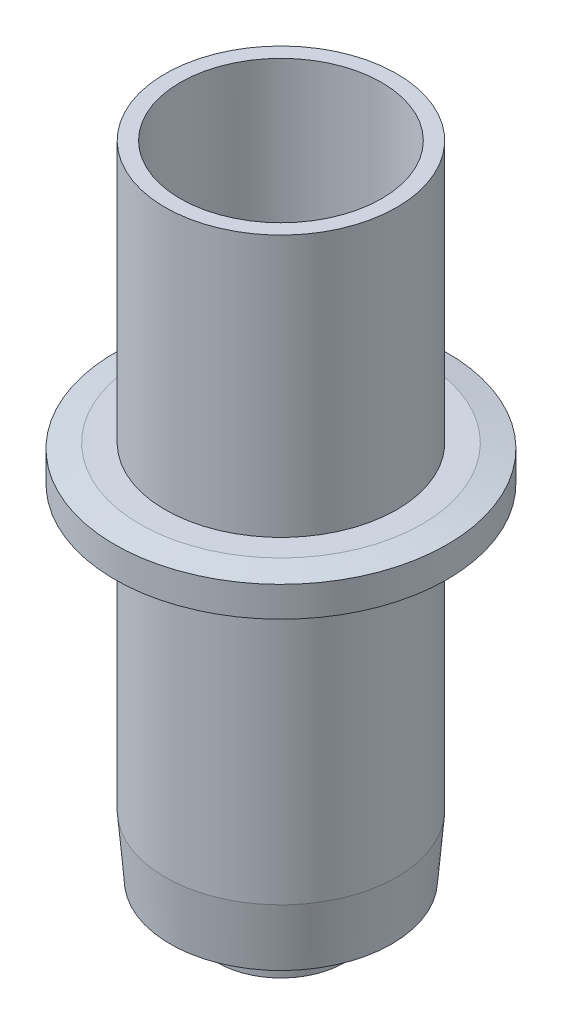
ISO-10303-21;
HEADER;
FILE_DESCRIPTION(('STEP AP214'),'2;1');
FILE_NAME('part.step','',(''),(''),'','','');
FILE_SCHEMA(('AUTOMOTIVE_DESIGN { 1 0 10303 214 1 1 1 1 }'));
ENDSEC;
DATA;
#1=APPLICATION_CONTEXT('core data for automotive mechanical design processes');
#2=APPLICATION_PROTOCOL_DEFINITION('international standard','automotive_design',2000,#1);
#3=PRODUCT_CONTEXT('',#1,'mechanical');
#4=PRODUCT('Part','Part','',(#3));
#5=PRODUCT_RELATED_PRODUCT_CATEGORY('part','',(#4));
#6=PRODUCT_DEFINITION_FORMATION('','',#4);
#7=PRODUCT_DEFINITION_CONTEXT('part definition',#1,'design');
#8=PRODUCT_DEFINITION('design','',#6,#7);
#9=PRODUCT_DEFINITION_SHAPE('','',#8);
#10=(LENGTH_UNIT() NAMED_UNIT(*) SI_UNIT(.MILLI.,.METRE.));
#11=(NAMED_UNIT(*) PLANE_ANGLE_UNIT() SI_UNIT($,.RADIAN.));
#12=(NAMED_UNIT(*) SI_UNIT($,.STERADIAN.) SOLID_ANGLE_UNIT());
#13=UNCERTAINTY_MEASURE_WITH_UNIT(LENGTH_MEASURE(1.E-05),#10,'distance_accuracy_value','');
#14=(GEOMETRIC_REPRESENTATION_CONTEXT(3) GLOBAL_UNCERTAINTY_ASSIGNED_CONTEXT((#13)) GLOBAL_UNIT_ASSIGNED_CONTEXT((#10,
#11,#12)) REPRESENTATION_CONTEXT('',''));
#15=CARTESIAN_POINT('',(0.,0.,0.));
#16=DIRECTION('',(0.,0.,1.));
#17=DIRECTION('',(1.,0.,0.));
#18=AXIS2_PLACEMENT_3D('',#15,#16,#17);
#19=CARTESIAN_POINT('',(0.,0.,0.));
#20=DIRECTION('',(0.,1.,0.));
#21=DIRECTION('',(-1.,0.,0.));
#22=AXIS2_PLACEMENT_3D('',#19,#20,#21);
#23=CONICAL_SURFACE('',#22,3.,0.036347621019028);
#24=CARTESIAN_POINT('',(0.,5.50000000000001,0.));
#25=DIRECTION('',(0.,-1.,0.));
#26=DIRECTION('',(1.,0.,0.));
#27=AXIS2_PLACEMENT_3D('',#24,#25,#26);
#28=CIRCLE('',#27,3.20000000000004);
#29=CARTESIAN_POINT('',(3.20000000000002,5.50000000000002,0.));
#30=VERTEX_POINT('',#29);
#31=EDGE_CURVE('E51',#30,#30,#28,.T.);
#32=ORIENTED_EDGE('',*,*,#31,.T.);
#33=EDGE_LOOP('',(#32));
#34=FACE_BOUND('',#33,.T.);
#35=CARTESIAN_POINT('',(0.,3.49999999999999,0.));
#36=DIRECTION('',(0.,-1.,0.));
#37=DIRECTION('',(1.,0.,0.));
#38=AXIS2_PLACEMENT_3D('',#35,#36,#37);
#39=CIRCLE('',#38,3.12727272727275);
#40=CARTESIAN_POINT('',(3.12727272727274,3.5,0.));
#41=VERTEX_POINT('',#40);
#42=EDGE_CURVE('E64',#41,#41,#39,.F.);
#43=ORIENTED_EDGE('',*,*,#42,.T.);
#44=EDGE_LOOP('',(#43));
#45=FACE_BOUND('',#44,.T.);
#46=ADVANCED_FACE('F34',(#34,#45),#23,.T.);
#47=CARTESIAN_POINT('',(0.,-1000.,-3.49148133884313E-12));
#48=DIRECTION('',(0.,-1.,0.));
#49=DIRECTION('',(0.,0.,-1.));
#50=AXIS2_PLACEMENT_3D('',#47,#48,#49);
#51=CYLINDRICAL_SURFACE('',#50,2.57500000000001);
#52=CARTESIAN_POINT('',(0.,6.86999999999993,0.));
#53=DIRECTION('',(0.,-1.,0.));
#54=DIRECTION('',(0.,0.,-1.));
#55=AXIS2_PLACEMENT_3D('',#52,#53,#54);
#56=CIRCLE('',#55,2.57500000000002);
#57=CARTESIAN_POINT('',(0.,6.86999999999994,-2.575));
#58=VERTEX_POINT('',#57);
#59=EDGE_CURVE('E52',#58,#58,#56,.T.);
#60=ORIENTED_EDGE('',*,*,#59,.F.);
#61=EDGE_LOOP('',(#60));
#62=FACE_BOUND('',#61,.T.);
#63=CARTESIAN_POINT('',(0.,3.50000000000006,0.));
#64=DIRECTION('',(0.,-1.,0.));
#65=DIRECTION('',(1.,0.,0.));
#66=AXIS2_PLACEMENT_3D('',#63,#64,#65);
#67=CIRCLE('',#66,2.57500000000001);
#68=CARTESIAN_POINT('',(2.57500000000001,3.50000000000007,0.));
#69=VERTEX_POINT('',#68);
#70=EDGE_CURVE('E37',#69,#69,#67,.F.);
#71=ORIENTED_EDGE('',*,*,#70,.F.);
#72=EDGE_LOOP('',(#71));
#73=FACE_BOUND('',#72,.T.);
#74=ADVANCED_FACE('F104',(#62,#73),#51,.F.);
#75=CARTESIAN_POINT('',(5.75,37.3,0.));
#76=DIRECTION('',(0.,1.,0.));
#77=DIRECTION('',(-1.,0.,0.));
#78=AXIS2_PLACEMENT_3D('',#75,#76,#77);
#79=PLANE('',#78);
#80=CARTESIAN_POINT('',(0.,37.3000000000001,1.30232253938849E-13));
#81=DIRECTION('',(0.,1.,0.));
#82=DIRECTION('',(-1.,0.,0.));
#83=AXIS2_PLACEMENT_3D('',#80,#81,#82);
#84=CIRCLE('',#83,5.00000000000008);
#85=CARTESIAN_POINT('',(-5.00000000000008,37.3000000000001,1.30232253938849E-13));
#86=VERTEX_POINT('',#85);
#87=EDGE_CURVE('E49',#86,#86,#84,.T.);
#88=ORIENTED_EDGE('',*,*,#87,.F.);
#89=EDGE_LOOP('',(#88));
#90=FACE_BOUND('',#89,.T.);
#91=CARTESIAN_POINT('',(-1.30232253938849E-13,37.3,0.));
#92=DIRECTION('',(0.,-1.,0.));
#93=DIRECTION('',(1.,0.,0.));
#94=AXIS2_PLACEMENT_3D('',#91,#92,#93);
#95=CIRCLE('',#94,5.75000000000013);
#96=CARTESIAN_POINT('',(5.75,37.3,0.));
#97=VERTEX_POINT('',#96);
#98=EDGE_CURVE('E12',#97,#97,#95,.T.);
#99=ORIENTED_EDGE('',*,*,#98,.F.);
#100=EDGE_LOOP('',(#99));
#101=FACE_BOUND('',#100,.T.);
#102=ADVANCED_FACE('F101',(#90,#101),#79,.T.);
#103=CARTESIAN_POINT('',(5.02600346399491E-13,-143.950460455854,0.));
#104=DIRECTION('',(0.,-1.,0.));
#105=DIRECTION('',(1.,0.,0.));
#106=AXIS2_PLACEMENT_3D('',#103,#104,#105);
#107=CYLINDRICAL_SURFACE('',#106,5.75000000000011);
#108=ORIENTED_EDGE('',*,*,#98,.T.);
#109=EDGE_LOOP('',(#108));
#110=FACE_BOUND('',#109,.T.);
#111=CARTESIAN_POINT('',(0.,24.3,0.));
#112=DIRECTION('',(0.,-1.,0.));
#113=DIRECTION('',(1.,0.,0.));
#114=AXIS2_PLACEMENT_3D('',#111,#112,#113);
#115=CIRCLE('',#114,5.75000000000009);
#116=CARTESIAN_POINT('',(5.75,24.3,0.));
#117=VERTEX_POINT('',#116);
#118=EDGE_CURVE('E41',#117,#117,#115,.T.);
#119=ORIENTED_EDGE('',*,*,#118,.F.);
#120=EDGE_LOOP('',(#119));
#121=FACE_BOUND('',#120,.T.);
#122=ADVANCED_FACE('F92',(#110,#121),#107,.T.);
#123=CARTESIAN_POINT('',(7.,24.3,0.));
#124=DIRECTION('',(0.,1.,0.));
#125=DIRECTION('',(-1.,0.,0.));
#126=AXIS2_PLACEMENT_3D('',#123,#124,#125);
#127=PLANE('',#126);
#128=ORIENTED_EDGE('',*,*,#118,.T.);
#129=EDGE_LOOP('',(#128));
#130=FACE_BOUND('',#129,.T.);
#131=CARTESIAN_POINT('',(0.,24.3,0.));
#132=DIRECTION('',(0.,-1.,0.));
#133=DIRECTION('',(1.,0.,0.));
#134=AXIS2_PLACEMENT_3D('',#131,#132,#133);
#135=CIRCLE('',#134,7.00000000000009);
#136=CARTESIAN_POINT('',(7.,24.3,0.));
#137=VERTEX_POINT('',#136);
#138=EDGE_CURVE('E46',#137,#137,#135,.T.);
#139=ORIENTED_EDGE('',*,*,#138,.F.);
#140=EDGE_LOOP('',(#139));
#141=FACE_BOUND('',#140,.T.);
#142=ADVANCED_FACE('F90',(#130,#141),#127,.T.);
#143=CARTESIAN_POINT('',(0.,24.05,0.));
#144=DIRECTION('',(0.,-1.,0.));
#145=DIRECTION('',(1.,0.,0.));
#146=AXIS2_PLACEMENT_3D('',#143,#144,#145);
#147=CONICAL_SURFACE('',#146,8.25000000000008,1.37340076694502);
#148=ORIENTED_EDGE('',*,*,#138,.T.);
#149=EDGE_LOOP('',(#148));
#150=FACE_BOUND('',#149,.T.);
#151=CARTESIAN_POINT('',(0.,24.05,0.));
#152=DIRECTION('',(0.,-1.,0.));
#153=DIRECTION('',(1.,0.,0.));
#154=AXIS2_PLACEMENT_3D('',#151,#152,#153);
#155=CIRCLE('',#154,8.25000000000008);
#156=CARTESIAN_POINT('',(8.25,24.05,0.));
#157=VERTEX_POINT('',#156);
#158=EDGE_CURVE('E82',#157,#157,#155,.T.);
#159=ORIENTED_EDGE('',*,*,#158,.F.);
#160=EDGE_LOOP('',(#159));
#161=FACE_BOUND('',#160,.T.);
#162=ADVANCED_FACE('F87',(#150,#161),#147,.T.);
#163=CARTESIAN_POINT('',(5.02600346399491E-13,-143.950460455854,0.));
#164=DIRECTION('',(0.,-1.,0.));
#165=DIRECTION('',(1.,0.,0.));
#166=AXIS2_PLACEMENT_3D('',#163,#164,#165);
#167=CYLINDRICAL_SURFACE('',#166,8.25000000000008);
#168=ORIENTED_EDGE('',*,*,#158,.T.);
#169=EDGE_LOOP('',(#168));
#170=FACE_BOUND('',#169,.T.);
#171=CARTESIAN_POINT('',(0.,22.55,0.));
#172=DIRECTION('',(0.,-1.,0.));
#173=DIRECTION('',(1.,0.,0.));
#174=AXIS2_PLACEMENT_3D('',#171,#172,#173);
#175=CIRCLE('',#174,8.25000000000008);
#176=CARTESIAN_POINT('',(8.25,22.55,0.));
#177=VERTEX_POINT('',#176);
#178=EDGE_CURVE('E79',#177,#177,#175,.T.);
#179=ORIENTED_EDGE('',*,*,#178,.F.);
#180=EDGE_LOOP('',(#179));
#181=FACE_BOUND('',#180,.T.);
#182=ADVANCED_FACE('F99',(#170,#181),#167,.T.);
#183=CARTESIAN_POINT('',(0.,22.3,0.));
#184=DIRECTION('',(0.,1.,0.));
#185=DIRECTION('',(-1.,0.,0.));
#186=AXIS2_PLACEMENT_3D('',#183,#184,#185);
#187=CONICAL_SURFACE('',#186,7.00000000000008,1.37340076694502);
#188=ORIENTED_EDGE('',*,*,#178,.T.);
#189=EDGE_LOOP('',(#188));
#190=FACE_BOUND('',#189,.T.);
#191=CARTESIAN_POINT('',(0.,22.3,0.));
#192=DIRECTION('',(0.,-1.,0.));
#193=DIRECTION('',(1.,0.,0.));
#194=AXIS2_PLACEMENT_3D('',#191,#192,#193);
#195=CIRCLE('',#194,7.00000000000008);
#196=CARTESIAN_POINT('',(7.,22.3,0.));
#197=VERTEX_POINT('',#196);
#198=EDGE_CURVE('E76',#197,#197,#195,.T.);
#199=ORIENTED_EDGE('',*,*,#198,.F.);
#200=EDGE_LOOP('',(#199));
#201=FACE_BOUND('',#200,.T.);
#202=ADVANCED_FACE('F148',(#190,#201),#187,.T.);
#203=CARTESIAN_POINT('',(5.75,22.3,0.));
#204=DIRECTION('',(0.,-1.,0.));
#205=DIRECTION('',(1.,0.,0.));
#206=AXIS2_PLACEMENT_3D('',#203,#204,#205);
#207=PLANE('',#206);
#208=ORIENTED_EDGE('',*,*,#198,.T.);
#209=EDGE_LOOP('',(#208));
#210=FACE_BOUND('',#209,.T.);
#211=CARTESIAN_POINT('',(0.,22.3,0.));
#212=DIRECTION('',(0.,-1.,0.));
#213=DIRECTION('',(1.,0.,0.));
#214=AXIS2_PLACEMENT_3D('',#211,#212,#213);
#215=CIRCLE('',#214,5.75000000000008);
#216=CARTESIAN_POINT('',(5.75,22.3,0.));
#217=VERTEX_POINT('',#216);
#218=EDGE_CURVE('E73',#217,#217,#215,.T.);
#219=ORIENTED_EDGE('',*,*,#218,.F.);
#220=EDGE_LOOP('',(#219));
#221=FACE_BOUND('',#220,.T.);
#222=ADVANCED_FACE('F144',(#210,#221),#207,.T.);
#223=CARTESIAN_POINT('',(5.02600346399491E-13,-143.950460455854,0.));
#224=DIRECTION('',(0.,-1.,0.));
#225=DIRECTION('',(1.,0.,0.));
#226=AXIS2_PLACEMENT_3D('',#223,#224,#225);
#227=CYLINDRICAL_SURFACE('',#226,5.75000000000005);
#228=ORIENTED_EDGE('',*,*,#218,.T.);
#229=EDGE_LOOP('',(#228));
#230=FACE_BOUND('',#229,.T.);
#231=CARTESIAN_POINT('',(0.,8.49999999999998,0.));
#232=DIRECTION('',(0.,-1.,0.));
#233=DIRECTION('',(1.,0.,0.));
#234=AXIS2_PLACEMENT_3D('',#231,#232,#233);
#235=CIRCLE('',#234,5.75000000000003);
#236=CARTESIAN_POINT('',(5.75,8.5,0.));
#237=VERTEX_POINT('',#236);
#238=EDGE_CURVE('E70',#237,#237,#235,.T.);
#239=ORIENTED_EDGE('',*,*,#238,.F.);
#240=EDGE_LOOP('',(#239));
#241=FACE_BOUND('',#240,.T.);
#242=ADVANCED_FACE('F140',(#230,#241),#227,.T.);
#243=CARTESIAN_POINT('',(0.,5.49999999999998,0.));
#244=DIRECTION('',(0.,1.,0.));
#245=DIRECTION('',(-1.,0.,0.));
#246=AXIS2_PLACEMENT_3D('',#243,#244,#245);
#247=CONICAL_SURFACE('',#246,5.50000000000052,0.0831412318882784);
#248=ORIENTED_EDGE('',*,*,#238,.T.);
#249=EDGE_LOOP('',(#248));
#250=FACE_BOUND('',#249,.T.);
#251=CARTESIAN_POINT('',(0.,5.49999999999998,0.));
#252=DIRECTION('',(0.,-1.,0.));
#253=DIRECTION('',(1.,0.,0.));
#254=AXIS2_PLACEMENT_3D('',#251,#252,#253);
#255=CIRCLE('',#254,5.50000000000052);
#256=CARTESIAN_POINT('',(5.5000000000005,5.5,0.));
#257=VERTEX_POINT('',#256);
#258=EDGE_CURVE('E56',#257,#257,#255,.T.);
#259=ORIENTED_EDGE('',*,*,#258,.F.);
#260=EDGE_LOOP('',(#259));
#261=FACE_BOUND('',#260,.T.);
#262=ADVANCED_FACE('F136',(#250,#261),#247,.T.);
#263=CARTESIAN_POINT('',(3.20000000000002,5.5,0.));
#264=DIRECTION('',(0.,-1.,0.));
#265=DIRECTION('',(1.,0.,0.));
#266=AXIS2_PLACEMENT_3D('',#263,#264,#265);
#267=PLANE('',#266);
#268=ORIENTED_EDGE('',*,*,#258,.T.);
#269=EDGE_LOOP('',(#268));
#270=FACE_BOUND('',#269,.T.);
#271=ORIENTED_EDGE('',*,*,#31,.F.);
#272=EDGE_LOOP('',(#271));
#273=FACE_BOUND('',#272,.T.);
#274=ADVANCED_FACE('F131',(#270,#273),#267,.T.);
#275=CARTESIAN_POINT('',(0.,6.87,-2.575));
#276=DIRECTION('',(0.,-1.,0.));
#277=DIRECTION('',(0.,0.,-1.));
#278=AXIS2_PLACEMENT_3D('',#275,#276,#277);
#279=PLANE('',#278);
#280=CARTESIAN_POINT('',(0.,6.86999999999993,0.));
#281=DIRECTION('',(0.,-1.,0.));
#282=DIRECTION('',(0.,0.,-1.));
#283=AXIS2_PLACEMENT_3D('',#280,#281,#282);
#284=CIRCLE('',#283,5.00000000000002);
#285=CARTESIAN_POINT('',(0.,6.86999999999995,-5.));
#286=VERTEX_POINT('',#285);
#287=EDGE_CURVE('E59',#286,#286,#284,.T.);
#288=ORIENTED_EDGE('',*,*,#287,.F.);
#289=EDGE_LOOP('',(#288));
#290=FACE_BOUND('',#289,.T.);
#291=ORIENTED_EDGE('',*,*,#59,.T.);
#292=EDGE_LOOP('',(#291));
#293=FACE_BOUND('',#292,.T.);
#294=ADVANCED_FACE('F127',(#290,#293),#279,.F.);
#295=CARTESIAN_POINT('',(0.,-1000.,-3.49148133884313E-12));
#296=DIRECTION('',(0.,-1.,0.));
#297=DIRECTION('',(0.,0.,-1.));
#298=AXIS2_PLACEMENT_3D('',#295,#296,#297);
#299=CYLINDRICAL_SURFACE('',#298,5.00000000000008);
#300=ORIENTED_EDGE('',*,*,#87,.T.);
#301=EDGE_LOOP('',(#300));
#302=FACE_BOUND('',#301,.T.);
#303=ORIENTED_EDGE('',*,*,#287,.T.);
#304=EDGE_LOOP('',(#303));
#305=FACE_BOUND('',#304,.T.);
#306=ADVANCED_FACE('F122',(#302,#305),#299,.F.);
#307=CARTESIAN_POINT('',(3.20000000000003,3.5,0.));
#308=DIRECTION('',(0.,-1.,0.));
#309=DIRECTION('',(1.,0.,0.));
#310=AXIS2_PLACEMENT_3D('',#307,#308,#309);
#311=PLANE('',#310);
#312=ORIENTED_EDGE('',*,*,#42,.F.);
#313=EDGE_LOOP('',(#312));
#314=FACE_BOUND('',#313,.T.);
#315=ORIENTED_EDGE('',*,*,#70,.T.);
#316=EDGE_LOOP('',(#315));
#317=FACE_BOUND('',#316,.T.);
#318=ADVANCED_FACE('F119',(#314,#317),#311,.T.);
#319=CLOSED_SHELL('',(#46,#74,#102,#122,#142,#162,#182,#202,#222,#242,#262,#274,#294,#306,#318));
#320=MANIFOLD_SOLID_BREP('B2',#319);
#321=ADVANCED_BREP_SHAPE_REPRESENTATION('',(#18,#320),#14);
#322=SHAPE_DEFINITION_REPRESENTATION(#9,#321);
ENDSEC;
END-ISO-10303-21;
